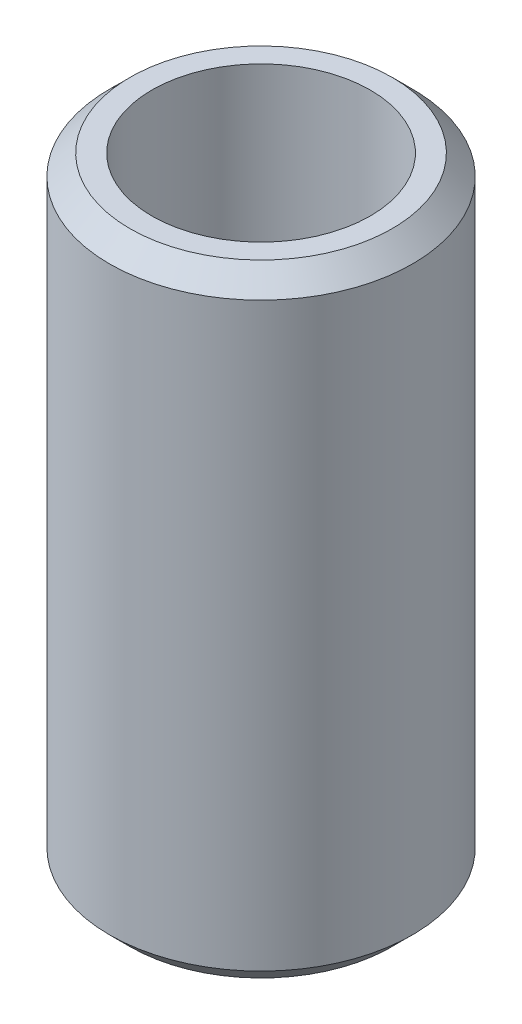
ISO-10303-21;
HEADER;
FILE_DESCRIPTION(('STEP AP214'),'2;1');
FILE_NAME('part.step','',(''),(''),'','','');
FILE_SCHEMA(('AUTOMOTIVE_DESIGN { 1 0 10303 214 1 1 1 1 }'));
ENDSEC;
DATA;
#1=APPLICATION_CONTEXT('core data for automotive mechanical design processes');
#2=APPLICATION_PROTOCOL_DEFINITION('international standard','automotive_design',2000,#1);
#3=PRODUCT_CONTEXT('',#1,'mechanical');
#4=PRODUCT('Part','Part','',(#3));
#5=PRODUCT_RELATED_PRODUCT_CATEGORY('part','',(#4));
#6=PRODUCT_DEFINITION_FORMATION('','',#4);
#7=PRODUCT_DEFINITION_CONTEXT('part definition',#1,'design');
#8=PRODUCT_DEFINITION('design','',#6,#7);
#9=PRODUCT_DEFINITION_SHAPE('','',#8);
#10=(LENGTH_UNIT() NAMED_UNIT(*) SI_UNIT(.MILLI.,.METRE.));
#11=(NAMED_UNIT(*) PLANE_ANGLE_UNIT() SI_UNIT($,.RADIAN.));
#12=(NAMED_UNIT(*) SI_UNIT($,.STERADIAN.) SOLID_ANGLE_UNIT());
#13=UNCERTAINTY_MEASURE_WITH_UNIT(LENGTH_MEASURE(1.E-05),#10,'distance_accuracy_value','');
#14=(GEOMETRIC_REPRESENTATION_CONTEXT(3) GLOBAL_UNCERTAINTY_ASSIGNED_CONTEXT((#13)) GLOBAL_UNIT_ASSIGNED_CONTEXT((#10,
#11,#12)) REPRESENTATION_CONTEXT('',''));
#15=CARTESIAN_POINT('',(0.,0.,0.));
#16=DIRECTION('',(0.,0.,1.));
#17=DIRECTION('',(1.,0.,0.));
#18=AXIS2_PLACEMENT_3D('',#15,#16,#17);
#19=CARTESIAN_POINT('',(0.,153.952544534129,0.));
#20=DIRECTION('',(0.,-1.,0.));
#21=DIRECTION('',(0.,0.,-1.));
#22=AXIS2_PLACEMENT_3D('',#19,#20,#21);
#23=CYLINDRICAL_SURFACE('',#22,37.5);
#24=CARTESIAN_POINT('',(0.,148.910626988833,0.));
#25=DIRECTION('',(0.,1.,0.));
#26=DIRECTION('',(0.,0.,1.));
#27=AXIS2_PLACEMENT_3D('',#24,#25,#26);
#28=CIRCLE('',#27,37.5);
#29=CARTESIAN_POINT('',(0.,148.910626988833,37.5));
#30=VERTEX_POINT('',#29);
#31=EDGE_CURVE('E50',#30,#30,#28,.F.);
#32=ORIENTED_EDGE('',*,*,#31,.T.);
#33=EDGE_LOOP('',(#32));
#34=FACE_BOUND('',#33,.T.);
#35=CARTESIAN_POINT('',(0.,5.04191754529656,0.));
#36=DIRECTION('',(0.,1.,0.));
#37=DIRECTION('',(0.,0.,1.));
#38=AXIS2_PLACEMENT_3D('',#35,#36,#37);
#39=CIRCLE('',#38,37.5);
#40=CARTESIAN_POINT('',(0.,5.04191754529656,37.5));
#41=VERTEX_POINT('',#40);
#42=EDGE_CURVE('E51',#41,#41,#39,.T.);
#43=ORIENTED_EDGE('',*,*,#42,.T.);
#44=EDGE_LOOP('',(#43));
#45=FACE_BOUND('',#44,.T.);
#46=ADVANCED_FACE('F39',(#34,#45),#23,.T.);
#47=CARTESIAN_POINT('',(0.,153.952544534129,0.));
#48=DIRECTION('',(0.,1.,0.));
#49=DIRECTION('',(0.,0.,1.));
#50=AXIS2_PLACEMENT_3D('',#47,#48,#49);
#51=PLANE('',#50);
#52=CARTESIAN_POINT('',(0.,153.952544534129,0.));
#53=DIRECTION('',(0.,1.,0.));
#54=DIRECTION('',(0.,0.,1.));
#55=AXIS2_PLACEMENT_3D('',#52,#53,#54);
#56=CIRCLE('',#55,32.4580824547034);
#57=CARTESIAN_POINT('',(0.,153.952544534129,32.4580824547034));
#58=VERTEX_POINT('',#57);
#59=EDGE_CURVE('E54',#58,#58,#56,.T.);
#60=ORIENTED_EDGE('',*,*,#59,.T.);
#61=EDGE_LOOP('',(#60));
#62=FACE_BOUND('',#61,.T.);
#63=CARTESIAN_POINT('',(0.,153.952544534129,0.));
#64=DIRECTION('',(0.,1.,0.));
#65=DIRECTION('',(0.,0.,1.));
#66=AXIS2_PLACEMENT_3D('',#63,#64,#65);
#67=CIRCLE('',#66,27.0343710882992);
#68=CARTESIAN_POINT('',(0.,153.952544534129,27.0343710882992));
#69=VERTEX_POINT('',#68);
#70=EDGE_CURVE('E58',#69,#69,#67,.T.);
#71=ORIENTED_EDGE('',*,*,#70,.F.);
#72=EDGE_LOOP('',(#71));
#73=FACE_BOUND('',#72,.T.);
#74=ADVANCED_FACE('F69',(#62,#73),#51,.T.);
#75=CARTESIAN_POINT('',(0.,0.,0.));
#76=DIRECTION('',(0.,1.,0.));
#77=DIRECTION('',(0.,0.,1.));
#78=AXIS2_PLACEMENT_3D('',#75,#76,#77);
#79=PLANE('',#78);
#80=CARTESIAN_POINT('',(0.,0.,0.));
#81=DIRECTION('',(0.,1.,0.));
#82=DIRECTION('',(0.,0.,1.));
#83=AXIS2_PLACEMENT_3D('',#80,#81,#82);
#84=CIRCLE('',#83,32.4580824547034);
#85=CARTESIAN_POINT('',(0.,0.,32.4580824547034));
#86=VERTEX_POINT('',#85);
#87=EDGE_CURVE('E10',#86,#86,#84,.F.);
#88=ORIENTED_EDGE('',*,*,#87,.T.);
#89=EDGE_LOOP('',(#88));
#90=FACE_BOUND('',#89,.T.);
#91=CARTESIAN_POINT('',(0.,0.,0.));
#92=DIRECTION('',(0.,1.,0.));
#93=DIRECTION('',(0.,0.,1.));
#94=AXIS2_PLACEMENT_3D('',#91,#92,#93);
#95=CIRCLE('',#94,27.0343710882992);
#96=CARTESIAN_POINT('',(0.,0.,27.0343710882992));
#97=VERTEX_POINT('',#96);
#98=EDGE_CURVE('E63',#97,#97,#95,.T.);
#99=ORIENTED_EDGE('',*,*,#98,.T.);
#100=EDGE_LOOP('',(#99));
#101=FACE_BOUND('',#100,.T.);
#102=ADVANCED_FACE('F75',(#90,#101),#79,.F.);
#103=CARTESIAN_POINT('',(0.,153.952544534129,0.));
#104=DIRECTION('',(0.,-1.,0.));
#105=DIRECTION('',(0.,0.,-1.));
#106=AXIS2_PLACEMENT_3D('',#103,#104,#105);
#107=CYLINDRICAL_SURFACE('',#106,27.0343710882992);
#108=ORIENTED_EDGE('',*,*,#70,.T.);
#109=EDGE_LOOP('',(#108));
#110=FACE_BOUND('',#109,.T.);
#111=ORIENTED_EDGE('',*,*,#98,.F.);
#112=EDGE_LOOP('',(#111));
#113=FACE_BOUND('',#112,.T.);
#114=ADVANCED_FACE('F70',(#110,#113),#107,.F.);
#115=CARTESIAN_POINT('',(0.,153.952544534129,0.));
#116=DIRECTION('',(0.,-1.,0.));
#117=DIRECTION('',(0.,0.,-1.));
#118=AXIS2_PLACEMENT_3D('',#115,#116,#117);
#119=CONICAL_SURFACE('',#118,32.4580824547034,0.785398163397443);
#120=ORIENTED_EDGE('',*,*,#31,.F.);
#121=EDGE_LOOP('',(#120));
#122=FACE_BOUND('',#121,.T.);
#123=ORIENTED_EDGE('',*,*,#59,.F.);
#124=EDGE_LOOP('',(#123));
#125=FACE_BOUND('',#124,.T.);
#126=ADVANCED_FACE('F81',(#122,#125),#119,.T.);
#127=CARTESIAN_POINT('',(0.,5.04191754529656,0.));
#128=DIRECTION('',(0.,1.,0.));
#129=DIRECTION('',(0.,0.,1.));
#130=AXIS2_PLACEMENT_3D('',#127,#128,#129);
#131=CONICAL_SURFACE('',#130,37.5,0.785398163397451);
#132=ORIENTED_EDGE('',*,*,#87,.F.);
#133=EDGE_LOOP('',(#132));
#134=FACE_BOUND('',#133,.T.);
#135=ORIENTED_EDGE('',*,*,#42,.F.);
#136=EDGE_LOOP('',(#135));
#137=FACE_BOUND('',#136,.T.);
#138=ADVANCED_FACE('F45',(#134,#137),#131,.T.);
#139=CLOSED_SHELL('',(#46,#74,#102,#114,#126,#138));
#140=MANIFOLD_SOLID_BREP('B2',#139);
#141=ADVANCED_BREP_SHAPE_REPRESENTATION('',(#18,#140),#14);
#142=SHAPE_DEFINITION_REPRESENTATION(#9,#141);
ENDSEC;
END-ISO-10303-21;
